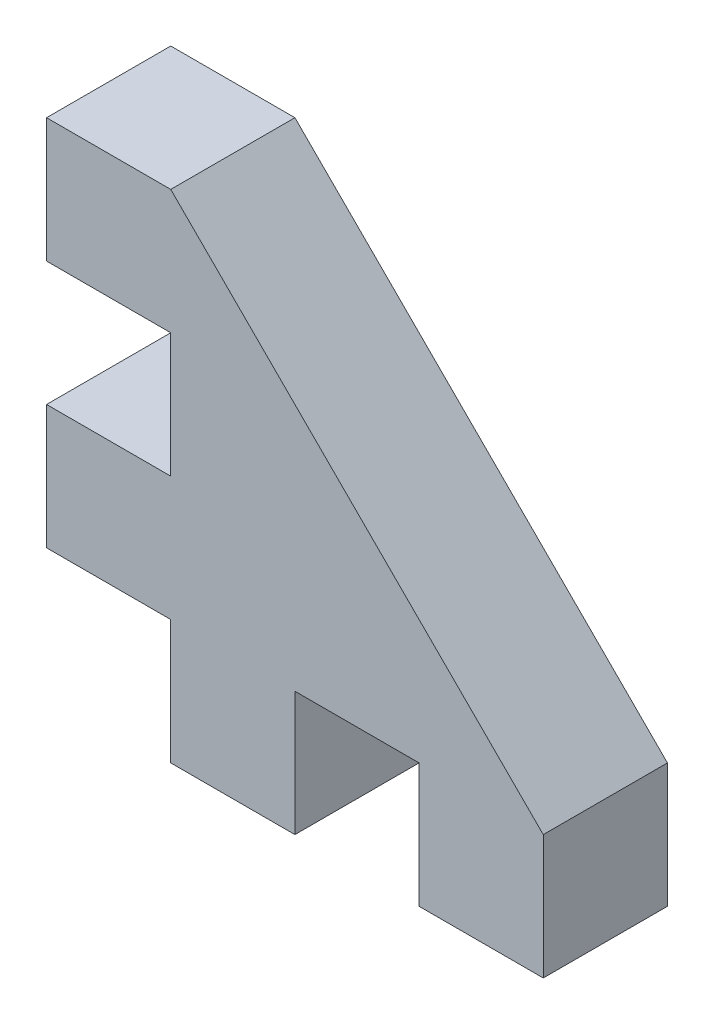
ISO-10303-21;
HEADER;
FILE_DESCRIPTION(('STEP AP214'),'2;1');
FILE_NAME('part.step','',(''),(''),'','','');
FILE_SCHEMA(('AUTOMOTIVE_DESIGN { 1 0 10303 214 1 1 1 1 }'));
ENDSEC;
DATA;
#1=APPLICATION_CONTEXT('core data for automotive mechanical design processes');
#2=APPLICATION_PROTOCOL_DEFINITION('international standard','automotive_design',2000,#1);
#3=PRODUCT_CONTEXT('',#1,'mechanical');
#4=PRODUCT('Part','Part','',(#3));
#5=PRODUCT_RELATED_PRODUCT_CATEGORY('part','',(#4));
#6=PRODUCT_DEFINITION_FORMATION('','',#4);
#7=PRODUCT_DEFINITION_CONTEXT('part definition',#1,'design');
#8=PRODUCT_DEFINITION('design','',#6,#7);
#9=PRODUCT_DEFINITION_SHAPE('','',#8);
#10=(LENGTH_UNIT() NAMED_UNIT(*) SI_UNIT(.MILLI.,.METRE.));
#11=(NAMED_UNIT(*) PLANE_ANGLE_UNIT() SI_UNIT($,.RADIAN.));
#12=(NAMED_UNIT(*) SI_UNIT($,.STERADIAN.) SOLID_ANGLE_UNIT());
#13=UNCERTAINTY_MEASURE_WITH_UNIT(LENGTH_MEASURE(1.E-05),#10,'distance_accuracy_value','');
#14=(GEOMETRIC_REPRESENTATION_CONTEXT(3) GLOBAL_UNCERTAINTY_ASSIGNED_CONTEXT((#13)) GLOBAL_UNIT_ASSIGNED_CONTEXT((#10,
#11,#12)) REPRESENTATION_CONTEXT('',''));
#15=CARTESIAN_POINT('',(0.,0.,0.));
#16=DIRECTION('',(0.,0.,1.));
#17=DIRECTION('',(1.,0.,0.));
#18=AXIS2_PLACEMENT_3D('',#15,#16,#17);
#19=CARTESIAN_POINT('',(-43.2430417966123,-5.73647342995169,5.));
#20=DIRECTION('',(0.,1.,0.));
#21=DIRECTION('',(0.,0.,1.));
#22=AXIS2_PLACEMENT_3D('',#19,#20,#21);
#23=PLANE('',#22);
#24=DIRECTION('',(1.,0.,0.));
#25=VECTOR('',#24,1.);
#26=CARTESIAN_POINT('',(-43.2430417966123,-5.73647342995169,0.));
#27=LINE('',#26,#25);
#28=CARTESIAN_POINT('',(-38.2430417966123,-5.73647342995169,0.));
#29=VERTEX_POINT('',#28);
#30=CARTESIAN_POINT('',(-33.2430417966123,-5.73647342995169,0.));
#31=VERTEX_POINT('',#30);
#32=EDGE_CURVE('E165',#29,#31,#27,.T.);
#33=ORIENTED_EDGE('',*,*,#32,.T.);
#34=DIRECTION('',(0.,0.,1.));
#35=VECTOR('',#34,1.);
#36=CARTESIAN_POINT('',(-33.2430417966123,-5.73647342995169,0.));
#37=LINE('',#36,#35);
#38=CARTESIAN_POINT('',(-33.2430417966123,-5.73647342995169,5.));
#39=VERTEX_POINT('',#38);
#40=EDGE_CURVE('E250',#31,#39,#37,.T.);
#41=ORIENTED_EDGE('',*,*,#40,.T.);
#42=DIRECTION('',(1.,0.,0.));
#43=VECTOR('',#42,1.);
#44=CARTESIAN_POINT('',(-43.2430417966123,-5.73647342995169,5.));
#45=LINE('',#44,#43);
#46=CARTESIAN_POINT('',(-38.2430417966123,-5.73647342995169,5.));
#47=VERTEX_POINT('',#46);
#48=EDGE_CURVE('E175',#47,#39,#45,.T.);
#49=ORIENTED_EDGE('',*,*,#48,.F.);
#50=DIRECTION('',(0.,0.,1.));
#51=VECTOR('',#50,1.);
#52=CARTESIAN_POINT('',(-38.2430417966123,-5.73647342995169,0.));
#53=LINE('',#52,#51);
#54=EDGE_CURVE('E205',#29,#47,#53,.T.);
#55=ORIENTED_EDGE('',*,*,#54,.F.);
#56=EDGE_LOOP('',(#33,#41,#49,#55));
#57=FACE_BOUND('',#56,.T.);
#58=ADVANCED_FACE('F32',(#57),#23,.F.);
#59=CARTESIAN_POINT('',(-43.2430417966123,14.2635265700483,5.));
#60=DIRECTION('',(1.,0.,0.));
#61=DIRECTION('',(0.,1.,0.));
#62=AXIS2_PLACEMENT_3D('',#59,#60,#61);
#63=PLANE('',#62);
#64=DIRECTION('',(0.,-1.,0.));
#65=VECTOR('',#64,1.);
#66=CARTESIAN_POINT('',(-43.2430417966123,14.2635265700483,0.));
#67=LINE('',#66,#65);
#68=CARTESIAN_POINT('',(-43.2430417966123,14.2635265700483,0.));
#69=VERTEX_POINT('',#68);
#70=CARTESIAN_POINT('',(-43.2430417966123,9.26352657004831,0.));
#71=VERTEX_POINT('',#70);
#72=EDGE_CURVE('E159',#69,#71,#67,.T.);
#73=ORIENTED_EDGE('',*,*,#72,.T.);
#74=DIRECTION('',(0.,0.,1.));
#75=VECTOR('',#74,1.);
#76=CARTESIAN_POINT('',(-43.2430417966123,9.26352657004831,0.));
#77=LINE('',#76,#75);
#78=CARTESIAN_POINT('',(-43.2430417966123,9.26352657004831,5.));
#79=VERTEX_POINT('',#78);
#80=EDGE_CURVE('E220',#71,#79,#77,.T.);
#81=ORIENTED_EDGE('',*,*,#80,.T.);
#82=DIRECTION('',(0.,-1.,0.));
#83=VECTOR('',#82,1.);
#84=CARTESIAN_POINT('',(-43.2430417966123,14.2635265700483,5.));
#85=LINE('',#84,#83);
#86=CARTESIAN_POINT('',(-43.2430417966123,14.2635265700483,5.));
#87=VERTEX_POINT('',#86);
#88=EDGE_CURVE('E163',#87,#79,#85,.T.);
#89=ORIENTED_EDGE('',*,*,#88,.F.);
#90=DIRECTION('',(0.,0.,-1.));
#91=VECTOR('',#90,1.);
#92=CARTESIAN_POINT('',(-43.2430417966123,14.2635265700483,5.));
#93=LINE('',#92,#91);
#94=EDGE_CURVE('E40',#87,#69,#93,.T.);
#95=ORIENTED_EDGE('',*,*,#94,.T.);
#96=EDGE_LOOP('',(#73,#81,#89,#95));
#97=FACE_BOUND('',#96,.T.);
#98=ADVANCED_FACE('F296',(#97),#63,.F.);
#99=CARTESIAN_POINT('',(-43.2430417966123,4.26352657004831,5.));
#100=VERTEX_POINT('',#99);
#101=CARTESIAN_POINT('',(-43.2430417966123,-0.736473429951691,5.));
#102=VERTEX_POINT('',#101);
#103=EDGE_CURVE('E160',#100,#102,#85,.T.);
#104=ORIENTED_EDGE('',*,*,#103,.F.);
#105=DIRECTION('',(0.,0.,1.));
#106=VECTOR('',#105,1.);
#107=CARTESIAN_POINT('',(-43.2430417966123,4.26352657004831,0.));
#108=LINE('',#107,#106);
#109=CARTESIAN_POINT('',(-43.2430417966123,4.26352657004831,0.));
#110=VERTEX_POINT('',#109);
#111=EDGE_CURVE('E225',#110,#100,#108,.T.);
#112=ORIENTED_EDGE('',*,*,#111,.F.);
#113=CARTESIAN_POINT('',(-43.2430417966123,-0.736473429951691,0.));
#114=VERTEX_POINT('',#113);
#115=EDGE_CURVE('E180',#110,#114,#67,.T.);
#116=ORIENTED_EDGE('',*,*,#115,.T.);
#117=DIRECTION('',(0.,0.,1.));
#118=VECTOR('',#117,1.);
#119=CARTESIAN_POINT('',(-43.2430417966123,-0.736473429951691,0.));
#120=LINE('',#119,#118);
#121=EDGE_CURVE('E210',#114,#102,#120,.T.);
#122=ORIENTED_EDGE('',*,*,#121,.T.);
#123=EDGE_LOOP('',(#104,#112,#116,#122));
#124=FACE_BOUND('',#123,.T.);
#125=ADVANCED_FACE('F34',(#124),#63,.F.);
#126=CARTESIAN_POINT('',(-28.2430417966123,-5.73647342995169,5.));
#127=VERTEX_POINT('',#126);
#128=CARTESIAN_POINT('',(-23.2430417966123,-5.73647342995169,5.));
#129=VERTEX_POINT('',#128);
#130=EDGE_CURVE('E199',#127,#129,#45,.T.);
#131=ORIENTED_EDGE('',*,*,#130,.F.);
#132=DIRECTION('',(0.,0.,1.));
#133=VECTOR('',#132,1.);
#134=CARTESIAN_POINT('',(-28.2430417966123,-5.73647342995169,0.));
#135=LINE('',#134,#133);
#136=CARTESIAN_POINT('',(-28.2430417966123,-5.73647342995169,0.));
#137=VERTEX_POINT('',#136);
#138=EDGE_CURVE('E193',#137,#127,#135,.T.);
#139=ORIENTED_EDGE('',*,*,#138,.F.);
#140=CARTESIAN_POINT('',(-23.2430417966123,-5.73647342995169,0.));
#141=VERTEX_POINT('',#140);
#142=EDGE_CURVE('E179',#137,#141,#27,.T.);
#143=ORIENTED_EDGE('',*,*,#142,.T.);
#144=DIRECTION('',(0.,0.,-1.));
#145=VECTOR('',#144,1.);
#146=CARTESIAN_POINT('',(-23.2430417966123,-5.73647342995169,5.));
#147=LINE('',#146,#145);
#148=EDGE_CURVE('E11',#129,#141,#147,.T.);
#149=ORIENTED_EDGE('',*,*,#148,.F.);
#150=EDGE_LOOP('',(#131,#139,#143,#149));
#151=FACE_BOUND('',#150,.T.);
#152=ADVANCED_FACE('F191',(#151),#23,.F.);
#153=CARTESIAN_POINT('',(-23.2430417966123,14.2635265700483,5.));
#154=DIRECTION('',(-1.,0.,0.));
#155=DIRECTION('',(0.,0.,1.));
#156=AXIS2_PLACEMENT_3D('',#153,#154,#155);
#157=PLANE('',#156);
#158=DIRECTION('',(0.,1.,0.));
#159=VECTOR('',#158,1.);
#160=CARTESIAN_POINT('',(-23.2430417966123,14.2635265700483,0.));
#161=LINE('',#160,#159);
#162=CARTESIAN_POINT('',(-23.2430417966123,-0.736473429951577,0.));
#163=VERTEX_POINT('',#162);
#164=EDGE_CURVE('E161',#141,#163,#161,.T.);
#165=ORIENTED_EDGE('',*,*,#164,.T.);
#166=DIRECTION('',(0.,0.,1.));
#167=VECTOR('',#166,1.);
#168=CARTESIAN_POINT('',(-23.2430417966123,-0.736473429951585,0.));
#169=LINE('',#168,#167);
#170=CARTESIAN_POINT('',(-23.2430417966123,-0.736473429951585,5.));
#171=VERTEX_POINT('',#170);
#172=EDGE_CURVE('E47',#163,#171,#169,.T.);
#173=ORIENTED_EDGE('',*,*,#172,.T.);
#174=DIRECTION('',(0.,1.,0.));
#175=VECTOR('',#174,1.);
#176=CARTESIAN_POINT('',(-23.2430417966123,14.2635265700483,5.));
#177=LINE('',#176,#175);
#178=EDGE_CURVE('E170',#129,#171,#177,.T.);
#179=ORIENTED_EDGE('',*,*,#178,.F.);
#180=ORIENTED_EDGE('',*,*,#148,.T.);
#181=EDGE_LOOP('',(#165,#173,#179,#180));
#182=FACE_BOUND('',#181,.T.);
#183=ADVANCED_FACE('F196',(#182),#157,.F.);
#184=CARTESIAN_POINT('',(-43.2430417966123,14.2635265700483,5.));
#185=DIRECTION('',(0.,-1.,0.));
#186=DIRECTION('',(0.,0.,-1.));
#187=AXIS2_PLACEMENT_3D('',#184,#185,#186);
#188=PLANE('',#187);
#189=DIRECTION('',(-1.,0.,0.));
#190=VECTOR('',#189,1.);
#191=CARTESIAN_POINT('',(-43.2430417966123,14.2635265700483,5.));
#192=LINE('',#191,#190);
#193=CARTESIAN_POINT('',(-38.2430417966123,14.2635265700483,5.));
#194=VERTEX_POINT('',#193);
#195=EDGE_CURVE('E153',#194,#87,#192,.T.);
#196=ORIENTED_EDGE('',*,*,#195,.F.);
#197=DIRECTION('',(0.,0.,1.));
#198=VECTOR('',#197,1.);
#199=CARTESIAN_POINT('',(-38.2430417966123,14.2635265700483,0.));
#200=LINE('',#199,#198);
#201=CARTESIAN_POINT('',(-38.2430417966123,14.2635265700483,0.));
#202=VERTEX_POINT('',#201);
#203=EDGE_CURVE('E139',#202,#194,#200,.T.);
#204=ORIENTED_EDGE('',*,*,#203,.F.);
#205=DIRECTION('',(-1.,0.,0.));
#206=VECTOR('',#205,1.);
#207=CARTESIAN_POINT('',(-43.2430417966123,14.2635265700483,0.));
#208=LINE('',#207,#206);
#209=EDGE_CURVE('E151',#202,#69,#208,.T.);
#210=ORIENTED_EDGE('',*,*,#209,.T.);
#211=ORIENTED_EDGE('',*,*,#94,.F.);
#212=EDGE_LOOP('',(#196,#204,#210,#211));
#213=FACE_BOUND('',#212,.T.);
#214=ADVANCED_FACE('F149',(#213),#188,.F.);
#215=CARTESIAN_POINT('',(0.,0.,5.));
#216=DIRECTION('',(0.,0.,1.));
#217=DIRECTION('',(1.,0.,0.));
#218=AXIS2_PLACEMENT_3D('',#215,#216,#217);
#219=PLANE('',#218);
#220=DIRECTION('',(0.707106781186551,-0.707106781186544,0.));
#221=VECTOR('',#220,1.);
#222=CARTESIAN_POINT('',(-38.2430417966123,14.2635265700483,5.));
#223=LINE('',#222,#221);
#224=EDGE_CURVE('E145',#194,#171,#223,.T.);
#225=ORIENTED_EDGE('',*,*,#224,.F.);
#226=ORIENTED_EDGE('',*,*,#195,.T.);
#227=ORIENTED_EDGE('',*,*,#88,.T.);
#228=DIRECTION('',(-1.,0.,0.));
#229=VECTOR('',#228,1.);
#230=CARTESIAN_POINT('',(-43.2430417966123,9.26352657004831,5.));
#231=LINE('',#230,#229);
#232=CARTESIAN_POINT('',(-38.2430417966123,9.26352657004831,5.));
#233=VERTEX_POINT('',#232);
#234=EDGE_CURVE('E234',#233,#79,#231,.T.);
#235=ORIENTED_EDGE('',*,*,#234,.F.);
#236=DIRECTION('',(0.,1.,0.));
#237=VECTOR('',#236,1.);
#238=CARTESIAN_POINT('',(-38.2430417966123,4.26352657004831,5.));
#239=LINE('',#238,#237);
#240=CARTESIAN_POINT('',(-38.2430417966123,4.26352657004831,5.));
#241=VERTEX_POINT('',#240);
#242=EDGE_CURVE('E237',#241,#233,#239,.T.);
#243=ORIENTED_EDGE('',*,*,#242,.F.);
#244=DIRECTION('',(1.,0.,0.));
#245=VECTOR('',#244,1.);
#246=CARTESIAN_POINT('',(-43.2430417966123,4.26352657004831,5.));
#247=LINE('',#246,#245);
#248=EDGE_CURVE('E240',#100,#241,#247,.T.);
#249=ORIENTED_EDGE('',*,*,#248,.F.);
#250=ORIENTED_EDGE('',*,*,#103,.T.);
#251=DIRECTION('',(-1.,0.,0.));
#252=VECTOR('',#251,1.);
#253=CARTESIAN_POINT('',(-43.2430417966123,-0.736473429951691,5.));
#254=LINE('',#253,#252);
#255=CARTESIAN_POINT('',(-38.2430417966123,-0.736473429951691,5.));
#256=VERTEX_POINT('',#255);
#257=EDGE_CURVE('E213',#256,#102,#254,.T.);
#258=ORIENTED_EDGE('',*,*,#257,.F.);
#259=DIRECTION('',(0.,1.,0.));
#260=VECTOR('',#259,1.);
#261=CARTESIAN_POINT('',(-38.2430417966123,-5.73647342995169,5.));
#262=LINE('',#261,#260);
#263=EDGE_CURVE('E217',#47,#256,#262,.T.);
#264=ORIENTED_EDGE('',*,*,#263,.F.);
#265=ORIENTED_EDGE('',*,*,#48,.T.);
#266=DIRECTION('',(0.,-1.,0.));
#267=VECTOR('',#266,1.);
#268=CARTESIAN_POINT('',(-33.2430417966123,-5.73647342995169,5.));
#269=LINE('',#268,#267);
#270=CARTESIAN_POINT('',(-33.2430417966123,-0.736473429951691,5.));
#271=VERTEX_POINT('',#270);
#272=EDGE_CURVE('E261',#271,#39,#269,.T.);
#273=ORIENTED_EDGE('',*,*,#272,.F.);
#274=DIRECTION('',(-1.,0.,0.));
#275=VECTOR('',#274,1.);
#276=CARTESIAN_POINT('',(-33.2430417966123,-0.736473429951691,5.));
#277=LINE('',#276,#275);
#278=CARTESIAN_POINT('',(-28.2430417966123,-0.736473429951691,5.));
#279=VERTEX_POINT('',#278);
#280=EDGE_CURVE('E256',#279,#271,#277,.T.);
#281=ORIENTED_EDGE('',*,*,#280,.F.);
#282=DIRECTION('',(0.,1.,0.));
#283=VECTOR('',#282,1.);
#284=CARTESIAN_POINT('',(-28.2430417966123,-5.73647342995169,5.));
#285=LINE('',#284,#283);
#286=EDGE_CURVE('E202',#127,#279,#285,.T.);
#287=ORIENTED_EDGE('',*,*,#286,.F.);
#288=ORIENTED_EDGE('',*,*,#130,.T.);
#289=ORIENTED_EDGE('',*,*,#178,.T.);
#290=EDGE_LOOP('',(#225,#226,#227,#235,#243,#249,#250,#258,#264,#265,#273,#281,#287,#288,#289));
#291=FACE_BOUND('',#290,.T.);
#292=ADVANCED_FACE('F197',(#291),#219,.T.);
#293=CARTESIAN_POINT('',(0.,0.,0.));
#294=DIRECTION('',(0.,0.,1.));
#295=DIRECTION('',(1.,0.,0.));
#296=AXIS2_PLACEMENT_3D('',#293,#294,#295);
#297=PLANE('',#296);
#298=ORIENTED_EDGE('',*,*,#209,.F.);
#299=DIRECTION('',(0.707106781186551,-0.707106781186544,0.));
#300=VECTOR('',#299,1.);
#301=CARTESIAN_POINT('',(-38.2430417966123,14.2635265700483,0.));
#302=LINE('',#301,#300);
#303=EDGE_CURVE('E136',#202,#163,#302,.T.);
#304=ORIENTED_EDGE('',*,*,#303,.T.);
#305=ORIENTED_EDGE('',*,*,#164,.F.);
#306=ORIENTED_EDGE('',*,*,#142,.F.);
#307=DIRECTION('',(0.,1.,0.));
#308=VECTOR('',#307,1.);
#309=CARTESIAN_POINT('',(-28.2430417966123,-5.73647342995169,0.));
#310=LINE('',#309,#308);
#311=CARTESIAN_POINT('',(-28.2430417966123,-0.736473429951691,0.));
#312=VERTEX_POINT('',#311);
#313=EDGE_CURVE('E264',#137,#312,#310,.T.);
#314=ORIENTED_EDGE('',*,*,#313,.T.);
#315=DIRECTION('',(-1.,0.,0.));
#316=VECTOR('',#315,1.);
#317=CARTESIAN_POINT('',(-33.2430417966123,-0.736473429951691,0.));
#318=LINE('',#317,#316);
#319=CARTESIAN_POINT('',(-33.2430417966123,-0.736473429951691,0.));
#320=VERTEX_POINT('',#319);
#321=EDGE_CURVE('E55',#312,#320,#318,.T.);
#322=ORIENTED_EDGE('',*,*,#321,.T.);
#323=DIRECTION('',(0.,-1.,0.));
#324=VECTOR('',#323,1.);
#325=CARTESIAN_POINT('',(-33.2430417966123,-5.73647342995169,0.));
#326=LINE('',#325,#324);
#327=EDGE_CURVE('E259',#320,#31,#326,.T.);
#328=ORIENTED_EDGE('',*,*,#327,.T.);
#329=ORIENTED_EDGE('',*,*,#32,.F.);
#330=DIRECTION('',(0.,1.,0.));
#331=VECTOR('',#330,1.);
#332=CARTESIAN_POINT('',(-38.2430417966123,-5.73647342995169,0.));
#333=LINE('',#332,#331);
#334=CARTESIAN_POINT('',(-38.2430417966123,-0.736473429951691,0.));
#335=VERTEX_POINT('',#334);
#336=EDGE_CURVE('E216',#29,#335,#333,.T.);
#337=ORIENTED_EDGE('',*,*,#336,.T.);
#338=DIRECTION('',(-1.,0.,0.));
#339=VECTOR('',#338,1.);
#340=CARTESIAN_POINT('',(-43.2430417966123,-0.736473429951691,0.));
#341=LINE('',#340,#339);
#342=EDGE_CURVE('E208',#335,#114,#341,.T.);
#343=ORIENTED_EDGE('',*,*,#342,.T.);
#344=ORIENTED_EDGE('',*,*,#115,.F.);
#345=DIRECTION('',(1.,0.,0.));
#346=VECTOR('',#345,1.);
#347=CARTESIAN_POINT('',(-43.2430417966123,4.26352657004831,0.));
#348=LINE('',#347,#346);
#349=CARTESIAN_POINT('',(-38.2430417966123,4.26352657004831,0.));
#350=VERTEX_POINT('',#349);
#351=EDGE_CURVE('E236',#110,#350,#348,.T.);
#352=ORIENTED_EDGE('',*,*,#351,.T.);
#353=DIRECTION('',(0.,1.,0.));
#354=VECTOR('',#353,1.);
#355=CARTESIAN_POINT('',(-38.2430417966123,4.26352657004831,0.));
#356=LINE('',#355,#354);
#357=CARTESIAN_POINT('',(-38.2430417966123,9.26352657004831,0.));
#358=VERTEX_POINT('',#357);
#359=EDGE_CURVE('E245',#350,#358,#356,.T.);
#360=ORIENTED_EDGE('',*,*,#359,.T.);
#361=DIRECTION('',(-1.,0.,0.));
#362=VECTOR('',#361,1.);
#363=CARTESIAN_POINT('',(-43.2430417966123,9.26352657004831,0.));
#364=LINE('',#363,#362);
#365=EDGE_CURVE('E228',#358,#71,#364,.T.);
#366=ORIENTED_EDGE('',*,*,#365,.T.);
#367=ORIENTED_EDGE('',*,*,#72,.F.);
#368=EDGE_LOOP('',(#298,#304,#305,#306,#314,#322,#328,#329,#337,#343,#344,#352,#360,#366,#367));
#369=FACE_BOUND('',#368,.T.);
#370=ADVANCED_FACE('F156',(#369),#297,.F.);
#371=CARTESIAN_POINT('',(-43.2430417966123,-0.736473429951691,0.));
#372=DIRECTION('',(0.,1.,0.));
#373=DIRECTION('',(0.,0.,1.));
#374=AXIS2_PLACEMENT_3D('',#371,#372,#373);
#375=PLANE('',#374);
#376=ORIENTED_EDGE('',*,*,#257,.T.);
#377=ORIENTED_EDGE('',*,*,#121,.F.);
#378=ORIENTED_EDGE('',*,*,#342,.F.);
#379=DIRECTION('',(0.,0.,1.));
#380=VECTOR('',#379,1.);
#381=CARTESIAN_POINT('',(-38.2430417966123,-0.736473429951691,0.));
#382=LINE('',#381,#380);
#383=EDGE_CURVE('E207',#335,#256,#382,.T.);
#384=ORIENTED_EDGE('',*,*,#383,.T.);
#385=EDGE_LOOP('',(#376,#377,#378,#384));
#386=FACE_BOUND('',#385,.T.);
#387=ADVANCED_FACE('F282',(#386),#375,.F.);
#388=CARTESIAN_POINT('',(-38.2430417966123,-5.73647342995169,0.));
#389=DIRECTION('',(1.,0.,0.));
#390=DIRECTION('',(0.,0.,-1.));
#391=AXIS2_PLACEMENT_3D('',#388,#389,#390);
#392=PLANE('',#391);
#393=ORIENTED_EDGE('',*,*,#263,.T.);
#394=ORIENTED_EDGE('',*,*,#383,.F.);
#395=ORIENTED_EDGE('',*,*,#336,.F.);
#396=ORIENTED_EDGE('',*,*,#54,.T.);
#397=EDGE_LOOP('',(#393,#394,#395,#396));
#398=FACE_BOUND('',#397,.T.);
#399=ADVANCED_FACE('F278',(#398),#392,.F.);
#400=CARTESIAN_POINT('',(-43.2430417966123,9.26352657004831,0.));
#401=DIRECTION('',(0.,1.,0.));
#402=DIRECTION('',(0.,0.,1.));
#403=AXIS2_PLACEMENT_3D('',#400,#401,#402);
#404=PLANE('',#403);
#405=ORIENTED_EDGE('',*,*,#234,.T.);
#406=ORIENTED_EDGE('',*,*,#80,.F.);
#407=ORIENTED_EDGE('',*,*,#365,.F.);
#408=DIRECTION('',(0.,0.,1.));
#409=VECTOR('',#408,1.);
#410=CARTESIAN_POINT('',(-38.2430417966123,9.26352657004831,0.));
#411=LINE('',#410,#409);
#412=EDGE_CURVE('E230',#358,#233,#411,.T.);
#413=ORIENTED_EDGE('',*,*,#412,.T.);
#414=EDGE_LOOP('',(#405,#406,#407,#413));
#415=FACE_BOUND('',#414,.T.);
#416=ADVANCED_FACE('F297',(#415),#404,.F.);
#417=CARTESIAN_POINT('',(-38.2430417966123,4.26352657004831,0.));
#418=DIRECTION('',(1.,0.,0.));
#419=DIRECTION('',(0.,0.,-1.));
#420=AXIS2_PLACEMENT_3D('',#417,#418,#419);
#421=PLANE('',#420);
#422=ORIENTED_EDGE('',*,*,#242,.T.);
#423=ORIENTED_EDGE('',*,*,#412,.F.);
#424=ORIENTED_EDGE('',*,*,#359,.F.);
#425=DIRECTION('',(0.,0.,1.));
#426=VECTOR('',#425,1.);
#427=CARTESIAN_POINT('',(-38.2430417966123,4.26352657004831,0.));
#428=LINE('',#427,#426);
#429=EDGE_CURVE('E227',#350,#241,#428,.T.);
#430=ORIENTED_EDGE('',*,*,#429,.T.);
#431=EDGE_LOOP('',(#422,#423,#424,#430));
#432=FACE_BOUND('',#431,.T.);
#433=ADVANCED_FACE('F293',(#432),#421,.F.);
#434=CARTESIAN_POINT('',(-43.2430417966123,4.26352657004831,0.));
#435=DIRECTION('',(0.,-1.,0.));
#436=DIRECTION('',(0.,0.,-1.));
#437=AXIS2_PLACEMENT_3D('',#434,#435,#436);
#438=PLANE('',#437);
#439=ORIENTED_EDGE('',*,*,#248,.T.);
#440=ORIENTED_EDGE('',*,*,#429,.F.);
#441=ORIENTED_EDGE('',*,*,#351,.F.);
#442=ORIENTED_EDGE('',*,*,#111,.T.);
#443=EDGE_LOOP('',(#439,#440,#441,#442));
#444=FACE_BOUND('',#443,.T.);
#445=ADVANCED_FACE('F288',(#444),#438,.F.);
#446=CARTESIAN_POINT('',(-33.2430417966123,-5.73647342995169,0.));
#447=DIRECTION('',(-1.,0.,0.));
#448=DIRECTION('',(0.,0.,1.));
#449=AXIS2_PLACEMENT_3D('',#446,#447,#448);
#450=PLANE('',#449);
#451=ORIENTED_EDGE('',*,*,#272,.T.);
#452=ORIENTED_EDGE('',*,*,#40,.F.);
#453=ORIENTED_EDGE('',*,*,#327,.F.);
#454=DIRECTION('',(0.,0.,1.));
#455=VECTOR('',#454,1.);
#456=CARTESIAN_POINT('',(-33.2430417966123,-0.736473429951691,0.));
#457=LINE('',#456,#455);
#458=EDGE_CURVE('E243',#320,#271,#457,.T.);
#459=ORIENTED_EDGE('',*,*,#458,.T.);
#460=EDGE_LOOP('',(#451,#452,#453,#459));
#461=FACE_BOUND('',#460,.T.);
#462=ADVANCED_FACE('F271',(#461),#450,.F.);
#463=CARTESIAN_POINT('',(-33.2430417966123,-0.736473429951691,0.));
#464=DIRECTION('',(0.,1.,0.));
#465=DIRECTION('',(0.,0.,1.));
#466=AXIS2_PLACEMENT_3D('',#463,#464,#465);
#467=PLANE('',#466);
#468=ORIENTED_EDGE('',*,*,#280,.T.);
#469=ORIENTED_EDGE('',*,*,#458,.F.);
#470=ORIENTED_EDGE('',*,*,#321,.F.);
#471=DIRECTION('',(0.,0.,1.));
#472=VECTOR('',#471,1.);
#473=CARTESIAN_POINT('',(-28.2430417966123,-0.736473429951691,0.));
#474=LINE('',#473,#472);
#475=EDGE_CURVE('E253',#312,#279,#474,.T.);
#476=ORIENTED_EDGE('',*,*,#475,.T.);
#477=EDGE_LOOP('',(#468,#469,#470,#476));
#478=FACE_BOUND('',#477,.T.);
#479=ADVANCED_FACE('F367',(#478),#467,.F.);
#480=CARTESIAN_POINT('',(-28.2430417966123,-5.73647342995169,0.));
#481=DIRECTION('',(1.,0.,0.));
#482=DIRECTION('',(0.,0.,-1.));
#483=AXIS2_PLACEMENT_3D('',#480,#481,#482);
#484=PLANE('',#483);
#485=ORIENTED_EDGE('',*,*,#286,.T.);
#486=ORIENTED_EDGE('',*,*,#475,.F.);
#487=ORIENTED_EDGE('',*,*,#313,.F.);
#488=ORIENTED_EDGE('',*,*,#138,.T.);
#489=EDGE_LOOP('',(#485,#486,#487,#488));
#490=FACE_BOUND('',#489,.T.);
#491=ADVANCED_FACE('F374',(#490),#484,.F.);
#492=CARTESIAN_POINT('',(-38.2430417966123,14.2635265700483,0.));
#493=DIRECTION('',(-0.707106781186544,-0.707106781186551,0.));
#494=DIRECTION('',(0.707106781186551,-0.707106781186544,0.));
#495=AXIS2_PLACEMENT_3D('',#492,#493,#494);
#496=PLANE('',#495);
#497=ORIENTED_EDGE('',*,*,#224,.T.);
#498=ORIENTED_EDGE('',*,*,#172,.F.);
#499=ORIENTED_EDGE('',*,*,#303,.F.);
#500=ORIENTED_EDGE('',*,*,#203,.T.);
#501=EDGE_LOOP('',(#497,#498,#499,#500));
#502=FACE_BOUND('',#501,.T.);
#503=ADVANCED_FACE('F138',(#502),#496,.F.);
#504=CLOSED_SHELL('',(#58,#98,#125,#152,#183,#214,#292,#370,#387,#399,#416,#433,#445,#462,#479,
#491,#503));
#505=MANIFOLD_SOLID_BREP('B2',#504);
#506=ADVANCED_BREP_SHAPE_REPRESENTATION('',(#18,#505),#14);
#507=SHAPE_DEFINITION_REPRESENTATION(#9,#506);
ENDSEC;
END-ISO-10303-21;
